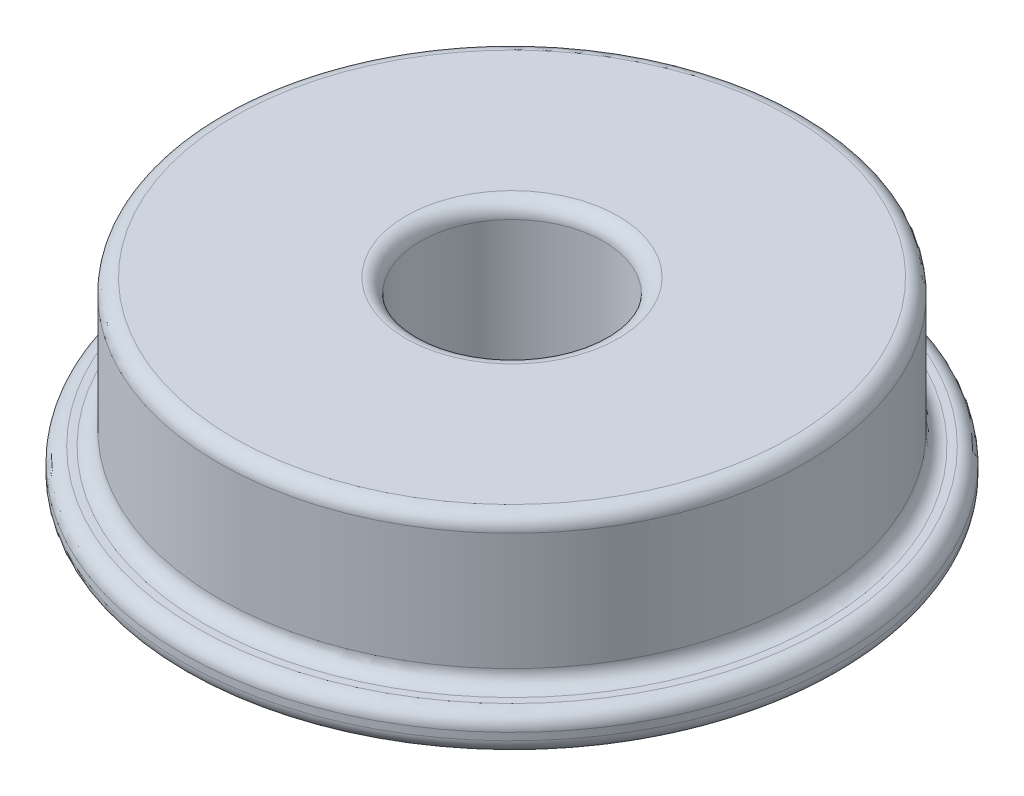
ISO-10303-21;
HEADER;
FILE_DESCRIPTION(('STEP AP214'),'2;1');
FILE_NAME('part.step','',(''),(''),'','','');
FILE_SCHEMA(('AUTOMOTIVE_DESIGN { 1 0 10303 214 1 1 1 1 }'));
ENDSEC;
DATA;
#1=APPLICATION_CONTEXT('core data for automotive mechanical design processes');
#2=APPLICATION_PROTOCOL_DEFINITION('international standard','automotive_design',2000,#1);
#3=PRODUCT_CONTEXT('',#1,'mechanical');
#4=PRODUCT('Part','Part','',(#3));
#5=PRODUCT_RELATED_PRODUCT_CATEGORY('part','',(#4));
#6=PRODUCT_DEFINITION_FORMATION('','',#4);
#7=PRODUCT_DEFINITION_CONTEXT('part definition',#1,'design');
#8=PRODUCT_DEFINITION('design','',#6,#7);
#9=PRODUCT_DEFINITION_SHAPE('','',#8);
#10=(LENGTH_UNIT() NAMED_UNIT(*) SI_UNIT(.MILLI.,.METRE.));
#11=(NAMED_UNIT(*) PLANE_ANGLE_UNIT() SI_UNIT($,.RADIAN.));
#12=(NAMED_UNIT(*) SI_UNIT($,.STERADIAN.) SOLID_ANGLE_UNIT());
#13=UNCERTAINTY_MEASURE_WITH_UNIT(LENGTH_MEASURE(1.E-05),#10,'distance_accuracy_value','');
#14=(GEOMETRIC_REPRESENTATION_CONTEXT(3) GLOBAL_UNCERTAINTY_ASSIGNED_CONTEXT((#13)) GLOBAL_UNIT_ASSIGNED_CONTEXT((#10,
#11,#12)) REPRESENTATION_CONTEXT('',''));
#15=CARTESIAN_POINT('',(0.,0.,0.));
#16=DIRECTION('',(0.,0.,1.));
#17=DIRECTION('',(1.,0.,0.));
#18=AXIS2_PLACEMENT_3D('',#15,#16,#17);
#19=CARTESIAN_POINT('',(0.,1.,0.));
#20=DIRECTION('',(0.,-1.,0.));
#21=DIRECTION('',(0.,0.,-1.));
#22=AXIS2_PLACEMENT_3D('',#19,#20,#21);
#23=CYLINDRICAL_SURFACE('',#22,9.);
#24=CARTESIAN_POINT('',(0.,0.6,0.));
#25=DIRECTION('',(0.,1.,0.));
#26=DIRECTION('',(0.,0.,1.));
#27=AXIS2_PLACEMENT_3D('',#24,#25,#26);
#28=CIRCLE('',#27,9.);
#29=CARTESIAN_POINT('',(0.,0.6,9.));
#30=VERTEX_POINT('',#29);
#31=EDGE_CURVE('E10',#30,#30,#28,.F.);
#32=ORIENTED_EDGE('',*,*,#31,.T.);
#33=EDGE_LOOP('',(#32));
#34=FACE_BOUND('',#33,.T.);
#35=CARTESIAN_POINT('',(0.,0.4,0.));
#36=DIRECTION('',(0.,1.,0.));
#37=DIRECTION('',(0.,0.,1.));
#38=AXIS2_PLACEMENT_3D('',#35,#36,#37);
#39=CIRCLE('',#38,9.);
#40=CARTESIAN_POINT('',(0.,0.4,9.));
#41=VERTEX_POINT('',#40);
#42=EDGE_CURVE('E42',#41,#41,#39,.T.);
#43=ORIENTED_EDGE('',*,*,#42,.T.);
#44=EDGE_LOOP('',(#43));
#45=FACE_BOUND('',#44,.T.);
#46=ADVANCED_FACE('F35',(#34,#45),#23,.T.);
#47=CARTESIAN_POINT('',(0.,1.,0.));
#48=DIRECTION('',(0.,1.,0.));
#49=DIRECTION('',(0.,0.,1.));
#50=AXIS2_PLACEMENT_3D('',#47,#48,#49);
#51=PLANE('',#50);
#52=CARTESIAN_POINT('',(0.,1.,0.));
#53=DIRECTION('',(0.,1.,0.));
#54=DIRECTION('',(0.,0.,1.));
#55=AXIS2_PLACEMENT_3D('',#52,#53,#54);
#56=CIRCLE('',#55,8.4);
#57=CARTESIAN_POINT('',(0.,1.,8.4));
#58=VERTEX_POINT('',#57);
#59=EDGE_CURVE('E46',#58,#58,#56,.F.);
#60=ORIENTED_EDGE('',*,*,#59,.T.);
#61=EDGE_LOOP('',(#60));
#62=FACE_BOUND('',#61,.T.);
#63=CARTESIAN_POINT('',(0.,1.,0.));
#64=DIRECTION('',(0.,1.,0.));
#65=DIRECTION('',(0.,0.,1.));
#66=AXIS2_PLACEMENT_3D('',#63,#64,#65);
#67=CIRCLE('',#66,8.6);
#68=CARTESIAN_POINT('',(0.,1.,8.6));
#69=VERTEX_POINT('',#68);
#70=EDGE_CURVE('E50',#69,#69,#67,.T.);
#71=ORIENTED_EDGE('',*,*,#70,.T.);
#72=EDGE_LOOP('',(#71));
#73=FACE_BOUND('',#72,.T.);
#74=ADVANCED_FACE('F91',(#62,#73),#51,.T.);
#75=CARTESIAN_POINT('',(0.,0.,0.));
#76=DIRECTION('',(0.,1.,0.));
#77=DIRECTION('',(0.,0.,1.));
#78=AXIS2_PLACEMENT_3D('',#75,#76,#77);
#79=PLANE('',#78);
#80=CARTESIAN_POINT('',(0.,0.,0.));
#81=DIRECTION('',(0.,1.,0.));
#82=DIRECTION('',(0.,0.,1.));
#83=AXIS2_PLACEMENT_3D('',#80,#81,#82);
#84=CIRCLE('',#83,2.9);
#85=CARTESIAN_POINT('',(0.,0.,2.9));
#86=VERTEX_POINT('',#85);
#87=EDGE_CURVE('E73',#86,#86,#84,.T.);
#88=ORIENTED_EDGE('',*,*,#87,.T.);
#89=EDGE_LOOP('',(#88));
#90=FACE_BOUND('',#89,.T.);
#91=CARTESIAN_POINT('',(0.,0.,0.));
#92=DIRECTION('',(0.,1.,0.));
#93=DIRECTION('',(0.,0.,1.));
#94=AXIS2_PLACEMENT_3D('',#91,#92,#93);
#95=CIRCLE('',#94,8.6);
#96=CARTESIAN_POINT('',(0.,0.,8.6));
#97=VERTEX_POINT('',#96);
#98=EDGE_CURVE('E76',#97,#97,#95,.F.);
#99=ORIENTED_EDGE('',*,*,#98,.T.);
#100=EDGE_LOOP('',(#99));
#101=FACE_BOUND('',#100,.T.);
#102=ADVANCED_FACE('F80',(#90,#101),#79,.F.);
#103=CARTESIAN_POINT('',(0.,5.,0.));
#104=DIRECTION('',(0.,-1.,0.));
#105=DIRECTION('',(0.,0.,-1.));
#106=AXIS2_PLACEMENT_3D('',#103,#104,#105);
#107=CYLINDRICAL_SURFACE('',#106,8.);
#108=CARTESIAN_POINT('',(0.,4.6,0.));
#109=DIRECTION('',(0.,1.,0.));
#110=DIRECTION('',(0.,0.,1.));
#111=AXIS2_PLACEMENT_3D('',#108,#109,#110);
#112=CIRCLE('',#111,8.);
#113=CARTESIAN_POINT('',(0.,4.6,8.));
#114=VERTEX_POINT('',#113);
#115=EDGE_CURVE('E55',#114,#114,#112,.F.);
#116=ORIENTED_EDGE('',*,*,#115,.T.);
#117=EDGE_LOOP('',(#116));
#118=FACE_BOUND('',#117,.T.);
#119=CARTESIAN_POINT('',(0.,1.4,0.));
#120=DIRECTION('',(0.,1.,0.));
#121=DIRECTION('',(0.,0.,1.));
#122=AXIS2_PLACEMENT_3D('',#119,#120,#121);
#123=CIRCLE('',#122,8.);
#124=CARTESIAN_POINT('',(0.,1.4,8.));
#125=VERTEX_POINT('',#124);
#126=EDGE_CURVE('E58',#125,#125,#123,.T.);
#127=ORIENTED_EDGE('',*,*,#126,.T.);
#128=EDGE_LOOP('',(#127));
#129=FACE_BOUND('',#128,.T.);
#130=ADVANCED_FACE('F121',(#118,#129),#107,.T.);
#131=CARTESIAN_POINT('',(0.,5.,0.));
#132=DIRECTION('',(0.,1.,0.));
#133=DIRECTION('',(0.,0.,1.));
#134=AXIS2_PLACEMENT_3D('',#131,#132,#133);
#135=PLANE('',#134);
#136=CARTESIAN_POINT('',(0.,5.,0.));
#137=DIRECTION('',(0.,1.,0.));
#138=DIRECTION('',(0.,0.,1.));
#139=AXIS2_PLACEMENT_3D('',#136,#137,#138);
#140=CIRCLE('',#139,2.9);
#141=CARTESIAN_POINT('',(0.,5.,2.9));
#142=VERTEX_POINT('',#141);
#143=EDGE_CURVE('E61',#142,#142,#140,.F.);
#144=ORIENTED_EDGE('',*,*,#143,.T.);
#145=EDGE_LOOP('',(#144));
#146=FACE_BOUND('',#145,.T.);
#147=CARTESIAN_POINT('',(0.,5.,0.));
#148=DIRECTION('',(0.,1.,0.));
#149=DIRECTION('',(0.,0.,1.));
#150=AXIS2_PLACEMENT_3D('',#147,#148,#149);
#151=CIRCLE('',#150,7.6);
#152=CARTESIAN_POINT('',(0.,5.,7.6));
#153=VERTEX_POINT('',#152);
#154=EDGE_CURVE('E64',#153,#153,#151,.T.);
#155=ORIENTED_EDGE('',*,*,#154,.T.);
#156=EDGE_LOOP('',(#155));
#157=FACE_BOUND('',#156,.T.);
#158=ADVANCED_FACE('F123',(#146,#157),#135,.T.);
#159=CARTESIAN_POINT('',(0.,0.,0.));
#160=DIRECTION('',(0.,1.,0.));
#161=DIRECTION('',(0.,0.,1.));
#162=AXIS2_PLACEMENT_3D('',#159,#160,#161);
#163=CYLINDRICAL_SURFACE('',#162,2.5);
#164=CARTESIAN_POINT('',(0.,0.4,0.));
#165=DIRECTION('',(0.,1.,0.));
#166=DIRECTION('',(0.,0.,1.));
#167=AXIS2_PLACEMENT_3D('',#164,#165,#166);
#168=CIRCLE('',#167,2.5);
#169=CARTESIAN_POINT('',(0.,0.4,2.5));
#170=VERTEX_POINT('',#169);
#171=EDGE_CURVE('E67',#170,#170,#168,.F.);
#172=ORIENTED_EDGE('',*,*,#171,.T.);
#173=EDGE_LOOP('',(#172));
#174=FACE_BOUND('',#173,.T.);
#175=CARTESIAN_POINT('',(0.,4.6,0.));
#176=DIRECTION('',(0.,1.,0.));
#177=DIRECTION('',(0.,0.,1.));
#178=AXIS2_PLACEMENT_3D('',#175,#176,#177);
#179=CIRCLE('',#178,2.5);
#180=CARTESIAN_POINT('',(0.,4.6,2.5));
#181=VERTEX_POINT('',#180);
#182=EDGE_CURVE('E70',#181,#181,#179,.T.);
#183=ORIENTED_EDGE('',*,*,#182,.T.);
#184=EDGE_LOOP('',(#183));
#185=FACE_BOUND('',#184,.T.);
#186=ADVANCED_FACE('F104',(#174,#185),#163,.F.);
#187=CARTESIAN_POINT('',(0.,0.4,0.));
#188=DIRECTION('',(0.,1.,0.));
#189=DIRECTION('',(0.,0.,1.));
#190=AXIS2_PLACEMENT_3D('',#187,#188,#189);
#191=TOROIDAL_SURFACE('',#190,2.9,0.4);
#192=ORIENTED_EDGE('',*,*,#171,.F.);
#193=EDGE_LOOP('',(#192));
#194=FACE_BOUND('',#193,.T.);
#195=ORIENTED_EDGE('',*,*,#87,.F.);
#196=EDGE_LOOP('',(#195));
#197=FACE_BOUND('',#196,.T.);
#198=ADVANCED_FACE('F100',(#194,#197),#191,.T.);
#199=CARTESIAN_POINT('',(0.,4.6,0.));
#200=DIRECTION('',(0.,1.,0.));
#201=DIRECTION('',(0.,0.,1.));
#202=AXIS2_PLACEMENT_3D('',#199,#200,#201);
#203=TOROIDAL_SURFACE('',#202,2.9,0.4);
#204=ORIENTED_EDGE('',*,*,#143,.F.);
#205=EDGE_LOOP('',(#204));
#206=FACE_BOUND('',#205,.T.);
#207=ORIENTED_EDGE('',*,*,#182,.F.);
#208=EDGE_LOOP('',(#207));
#209=FACE_BOUND('',#208,.T.);
#210=ADVANCED_FACE('F103',(#206,#209),#203,.T.);
#211=CARTESIAN_POINT('',(0.,4.6,0.));
#212=DIRECTION('',(0.,1.,0.));
#213=DIRECTION('',(0.,0.,1.));
#214=AXIS2_PLACEMENT_3D('',#211,#212,#213);
#215=TOROIDAL_SURFACE('',#214,7.6,0.4);
#216=ORIENTED_EDGE('',*,*,#115,.F.);
#217=EDGE_LOOP('',(#216));
#218=FACE_BOUND('',#217,.T.);
#219=ORIENTED_EDGE('',*,*,#154,.F.);
#220=EDGE_LOOP('',(#219));
#221=FACE_BOUND('',#220,.T.);
#222=ADVANCED_FACE('F108',(#218,#221),#215,.T.);
#223=CARTESIAN_POINT('',(0.,1.4,0.));
#224=DIRECTION('',(0.,1.,0.));
#225=DIRECTION('',(0.,0.,1.));
#226=AXIS2_PLACEMENT_3D('',#223,#224,#225);
#227=TOROIDAL_SURFACE('',#226,8.4,0.4);
#228=ORIENTED_EDGE('',*,*,#59,.F.);
#229=EDGE_LOOP('',(#228));
#230=FACE_BOUND('',#229,.T.);
#231=ORIENTED_EDGE('',*,*,#126,.F.);
#232=EDGE_LOOP('',(#231));
#233=FACE_BOUND('',#232,.T.);
#234=ADVANCED_FACE('F88',(#230,#233),#227,.F.);
#235=CARTESIAN_POINT('',(0.,0.6,0.));
#236=DIRECTION('',(0.,1.,0.));
#237=DIRECTION('',(0.,0.,1.));
#238=AXIS2_PLACEMENT_3D('',#235,#236,#237);
#239=TOROIDAL_SURFACE('',#238,8.6,0.4);
#240=ORIENTED_EDGE('',*,*,#31,.F.);
#241=EDGE_LOOP('',(#240));
#242=FACE_BOUND('',#241,.T.);
#243=ORIENTED_EDGE('',*,*,#70,.F.);
#244=EDGE_LOOP('',(#243));
#245=FACE_BOUND('',#244,.T.);
#246=ADVANCED_FACE('F84',(#242,#245),#239,.T.);
#247=CARTESIAN_POINT('',(0.,0.4,0.));
#248=DIRECTION('',(0.,1.,0.));
#249=DIRECTION('',(0.,0.,1.));
#250=AXIS2_PLACEMENT_3D('',#247,#248,#249);
#251=TOROIDAL_SURFACE('',#250,8.6,0.4);
#252=ORIENTED_EDGE('',*,*,#98,.F.);
#253=EDGE_LOOP('',(#252));
#254=FACE_BOUND('',#253,.T.);
#255=ORIENTED_EDGE('',*,*,#42,.F.);
#256=EDGE_LOOP('',(#255));
#257=FACE_BOUND('',#256,.T.);
#258=ADVANCED_FACE('F37',(#254,#257),#251,.T.);
#259=CLOSED_SHELL('',(#46,#74,#102,#130,#158,#186,#198,#210,#222,#234,#246,#258));
#260=MANIFOLD_SOLID_BREP('B2',#259);
#261=ADVANCED_BREP_SHAPE_REPRESENTATION('',(#18,#260),#14);
#262=SHAPE_DEFINITION_REPRESENTATION(#9,#261);
ENDSEC;
END-ISO-10303-21;
